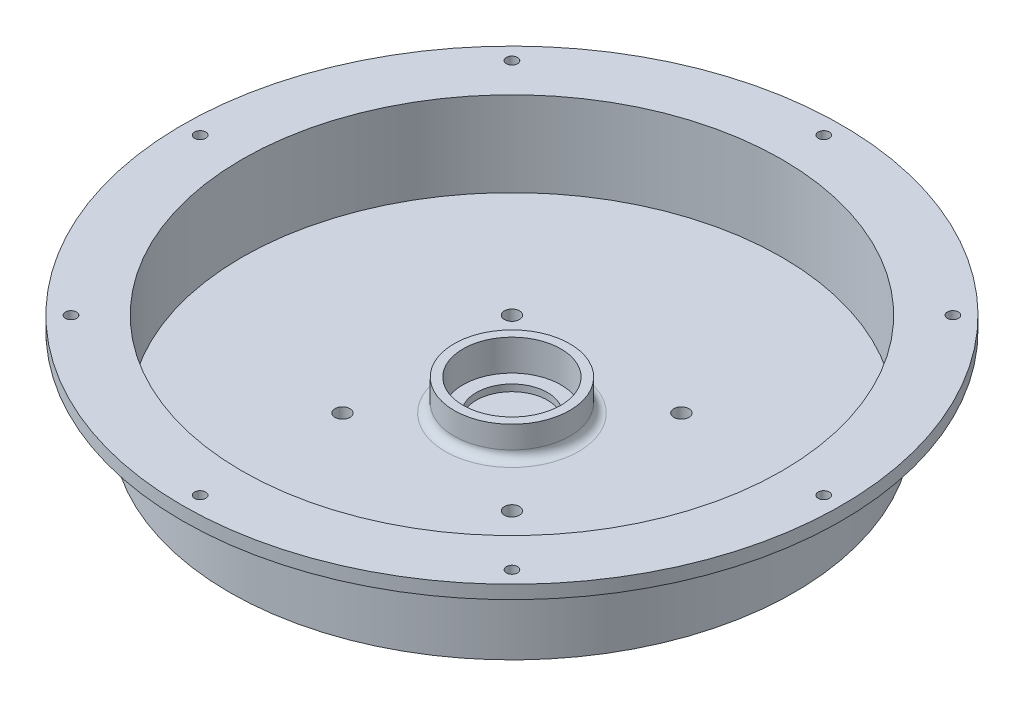
ISO-10303-21;
HEADER;
FILE_DESCRIPTION(('STEP AP214'),'2;1');
FILE_NAME('part.step','',(''),(''),'','','');
FILE_SCHEMA(('AUTOMOTIVE_DESIGN { 1 0 10303 214 1 1 1 1 }'));
ENDSEC;
DATA;
#1=APPLICATION_CONTEXT('core data for automotive mechanical design processes');
#2=APPLICATION_PROTOCOL_DEFINITION('international standard','automotive_design',2000,#1);
#3=PRODUCT_CONTEXT('',#1,'mechanical');
#4=PRODUCT('Part','Part','',(#3));
#5=PRODUCT_RELATED_PRODUCT_CATEGORY('part','',(#4));
#6=PRODUCT_DEFINITION_FORMATION('','',#4);
#7=PRODUCT_DEFINITION_CONTEXT('part definition',#1,'design');
#8=PRODUCT_DEFINITION('design','',#6,#7);
#9=PRODUCT_DEFINITION_SHAPE('','',#8);
#10=(LENGTH_UNIT() NAMED_UNIT(*) SI_UNIT(.MILLI.,.METRE.));
#11=(NAMED_UNIT(*) PLANE_ANGLE_UNIT() SI_UNIT($,.RADIAN.));
#12=(NAMED_UNIT(*) SI_UNIT($,.STERADIAN.) SOLID_ANGLE_UNIT());
#13=UNCERTAINTY_MEASURE_WITH_UNIT(LENGTH_MEASURE(1.E-05),#10,'distance_accuracy_value','');
#14=(GEOMETRIC_REPRESENTATION_CONTEXT(3) GLOBAL_UNCERTAINTY_ASSIGNED_CONTEXT((#13)) GLOBAL_UNIT_ASSIGNED_CONTEXT((#10,
#11,#12)) REPRESENTATION_CONTEXT('',''));
#15=CARTESIAN_POINT('',(0.,0.,0.));
#16=DIRECTION('',(0.,0.,1.));
#17=DIRECTION('',(1.,0.,0.));
#18=AXIS2_PLACEMENT_3D('',#15,#16,#17);
#19=CARTESIAN_POINT('',(0.,22.225,0.));
#20=DIRECTION('',(0.,1.,0.));
#21=DIRECTION('',(0.,0.,1.));
#22=AXIS2_PLACEMENT_3D('',#19,#20,#21);
#23=PLANE('',#22);
#24=CARTESIAN_POINT('',(-49.5681853611776,22.225,-49.5681853611764));
#25=DIRECTION('',(0.,1.,0.));
#26=DIRECTION('',(0.,0.,1.));
#27=AXIS2_PLACEMENT_3D('',#24,#25,#26);
#28=CIRCLE('',#27,1.24999999999999);
#29=CARTESIAN_POINT('',(-49.5681853611776,22.225,-48.3181853611764));
#30=VERTEX_POINT('',#29);
#31=EDGE_CURVE('E98',#30,#30,#28,.T.);
#32=ORIENTED_EDGE('',*,*,#31,.F.);
#33=EDGE_LOOP('',(#32));
#34=FACE_BOUND('',#33,.T.);
#35=CARTESIAN_POINT('',(-7.34258525558711E-13,22.225,-70.1));
#36=DIRECTION('',(0.,1.,0.));
#37=DIRECTION('',(0.,0.,1.));
#38=AXIS2_PLACEMENT_3D('',#35,#36,#37);
#39=CIRCLE('',#38,1.24999999999999);
#40=CARTESIAN_POINT('',(-7.34258525558711E-13,22.225,-68.85));
#41=VERTEX_POINT('',#40);
#42=EDGE_CURVE('E97',#41,#41,#39,.T.);
#43=ORIENTED_EDGE('',*,*,#42,.F.);
#44=EDGE_LOOP('',(#43));
#45=FACE_BOUND('',#44,.T.);
#46=CARTESIAN_POINT('',(49.5681853611765,22.225,-49.5681853611774));
#47=DIRECTION('',(0.,1.,0.));
#48=DIRECTION('',(0.,0.,1.));
#49=AXIS2_PLACEMENT_3D('',#46,#47,#48);
#50=CIRCLE('',#49,1.24999999999999);
#51=CARTESIAN_POINT('',(49.5681853611765,22.225,-48.3181853611774));
#52=VERTEX_POINT('',#51);
#53=EDGE_CURVE('E104',#52,#52,#50,.T.);
#54=ORIENTED_EDGE('',*,*,#53,.F.);
#55=EDGE_LOOP('',(#54));
#56=FACE_BOUND('',#55,.T.);
#57=CARTESIAN_POINT('',(70.1,22.225,0.));
#58=DIRECTION('',(0.,1.,0.));
#59=DIRECTION('',(0.,0.,1.));
#60=AXIS2_PLACEMENT_3D('',#57,#58,#59);
#61=CIRCLE('',#60,1.24999999999999);
#62=CARTESIAN_POINT('',(70.1,22.225,1.24999999999999));
#63=VERTEX_POINT('',#62);
#64=EDGE_CURVE('E103',#63,#63,#61,.T.);
#65=ORIENTED_EDGE('',*,*,#64,.F.);
#66=EDGE_LOOP('',(#65));
#67=FACE_BOUND('',#66,.T.);
#68=CARTESIAN_POINT('',(49.5681853611772,22.225,49.5681853611767));
#69=DIRECTION('',(0.,1.,0.));
#70=DIRECTION('',(0.,0.,1.));
#71=AXIS2_PLACEMENT_3D('',#68,#69,#70);
#72=CIRCLE('',#71,1.24999999999999);
#73=CARTESIAN_POINT('',(49.5681853611772,22.225,50.8181853611767));
#74=VERTEX_POINT('',#73);
#75=EDGE_CURVE('E108',#74,#74,#72,.T.);
#76=ORIENTED_EDGE('',*,*,#75,.F.);
#77=EDGE_LOOP('',(#76));
#78=FACE_BOUND('',#77,.T.);
#79=CARTESIAN_POINT('',(2.44752841852904E-13,22.225,70.1));
#80=DIRECTION('',(0.,1.,0.));
#81=DIRECTION('',(0.,0.,1.));
#82=AXIS2_PLACEMENT_3D('',#79,#80,#81);
#83=CIRCLE('',#82,1.24999999999999);
#84=CARTESIAN_POINT('',(2.44752841852904E-13,22.225,71.35));
#85=VERTEX_POINT('',#84);
#86=EDGE_CURVE('E113',#85,#85,#83,.T.);
#87=ORIENTED_EDGE('',*,*,#86,.F.);
#88=EDGE_LOOP('',(#87));
#89=FACE_BOUND('',#88,.T.);
#90=CARTESIAN_POINT('',(-49.5681853611769,22.225,49.5681853611771));
#91=DIRECTION('',(0.,1.,0.));
#92=DIRECTION('',(0.,0.,1.));
#93=AXIS2_PLACEMENT_3D('',#90,#91,#92);
#94=CIRCLE('',#93,1.24999999999999);
#95=CARTESIAN_POINT('',(-49.5681853611769,22.225,50.8181853611771));
#96=VERTEX_POINT('',#95);
#97=EDGE_CURVE('E119',#96,#96,#94,.T.);
#98=ORIENTED_EDGE('',*,*,#97,.F.);
#99=EDGE_LOOP('',(#98));
#100=FACE_BOUND('',#99,.T.);
#101=CARTESIAN_POINT('',(-70.1,22.225,0.));
#102=DIRECTION('',(0.,1.,0.));
#103=DIRECTION('',(0.,0.,1.));
#104=AXIS2_PLACEMENT_3D('',#101,#102,#103);
#105=CIRCLE('',#104,1.24999999999999);
#106=CARTESIAN_POINT('',(-70.1,22.225,1.24999999999999));
#107=VERTEX_POINT('',#106);
#108=EDGE_CURVE('E118',#107,#107,#105,.T.);
#109=ORIENTED_EDGE('',*,*,#108,.F.);
#110=EDGE_LOOP('',(#109));
#111=FACE_BOUND('',#110,.T.);
#112=CARTESIAN_POINT('',(0.,22.225,0.));
#113=DIRECTION('',(0.,1.,0.));
#114=DIRECTION('',(0.,0.,1.));
#115=AXIS2_PLACEMENT_3D('',#112,#113,#114);
#116=CIRCLE('',#115,60.690000065);
#117=CARTESIAN_POINT('',(0.,22.225,60.690000065));
#118=VERTEX_POINT('',#117);
#119=EDGE_CURVE('E136',#118,#118,#116,.T.);
#120=ORIENTED_EDGE('',*,*,#119,.F.);
#121=EDGE_LOOP('',(#120));
#122=FACE_BOUND('',#121,.T.);
#123=CARTESIAN_POINT('',(0.,22.225,0.));
#124=DIRECTION('',(0.,1.,0.));
#125=DIRECTION('',(0.,0.,1.));
#126=AXIS2_PLACEMENT_3D('',#123,#124,#125);
#127=CIRCLE('',#126,74.0950000325);
#128=CARTESIAN_POINT('',(0.,22.225,74.0950000325));
#129=VERTEX_POINT('',#128);
#130=EDGE_CURVE('E124',#129,#129,#127,.T.);
#131=ORIENTED_EDGE('',*,*,#130,.T.);
#132=EDGE_LOOP('',(#131));
#133=FACE_BOUND('',#132,.T.);
#134=ADVANCED_FACE('F62',(#34,#45,#56,#67,#78,#89,#100,#111,#122,#133),#23,.T.);
#135=CARTESIAN_POINT('',(0.,22.225,0.));
#136=DIRECTION('',(0.,-1.,0.));
#137=DIRECTION('',(0.,0.,-1.));
#138=AXIS2_PLACEMENT_3D('',#135,#136,#137);
#139=CYLINDRICAL_SURFACE('',#138,60.690000065);
#140=CARTESIAN_POINT('',(0.,3.175,0.));
#141=DIRECTION('',(0.,1.,0.));
#142=DIRECTION('',(0.,0.,1.));
#143=AXIS2_PLACEMENT_3D('',#140,#141,#142);
#144=CIRCLE('',#143,60.690000065);
#145=CARTESIAN_POINT('',(0.,3.175,60.690000065));
#146=VERTEX_POINT('',#145);
#147=EDGE_CURVE('E128',#146,#146,#144,.T.);
#148=ORIENTED_EDGE('',*,*,#147,.F.);
#149=EDGE_LOOP('',(#148));
#150=FACE_BOUND('',#149,.T.);
#151=ORIENTED_EDGE('',*,*,#119,.T.);
#152=EDGE_LOOP('',(#151));
#153=FACE_BOUND('',#152,.T.);
#154=ADVANCED_FACE('F232',(#150,#153),#139,.F.);
#155=CARTESIAN_POINT('',(0.,3.175,0.));
#156=DIRECTION('',(0.,1.,0.));
#157=DIRECTION('',(0.,0.,1.));
#158=AXIS2_PLACEMENT_3D('',#155,#156,#157);
#159=PLANE('',#158);
#160=CARTESIAN_POINT('',(19.05,3.175,-19.05));
#161=DIRECTION('',(0.,1.,0.));
#162=DIRECTION('',(0.,0.,1.));
#163=AXIS2_PLACEMENT_3D('',#160,#161,#162);
#164=CIRCLE('',#163,1.7);
#165=CARTESIAN_POINT('',(19.05,3.175,-17.35));
#166=VERTEX_POINT('',#165);
#167=EDGE_CURVE('E198',#166,#166,#164,.T.);
#168=ORIENTED_EDGE('',*,*,#167,.F.);
#169=EDGE_LOOP('',(#168));
#170=FACE_BOUND('',#169,.T.);
#171=CARTESIAN_POINT('',(-19.05,3.175,19.05));
#172=DIRECTION('',(0.,1.,0.));
#173=DIRECTION('',(0.,0.,1.));
#174=AXIS2_PLACEMENT_3D('',#171,#172,#173);
#175=CIRCLE('',#174,1.7);
#176=CARTESIAN_POINT('',(-19.05,3.175,20.75));
#177=VERTEX_POINT('',#176);
#178=EDGE_CURVE('E205',#177,#177,#175,.T.);
#179=ORIENTED_EDGE('',*,*,#178,.F.);
#180=EDGE_LOOP('',(#179));
#181=FACE_BOUND('',#180,.T.);
#182=CARTESIAN_POINT('',(-19.05,3.175,-19.05));
#183=DIRECTION('',(0.,1.,0.));
#184=DIRECTION('',(0.,0.,1.));
#185=AXIS2_PLACEMENT_3D('',#182,#183,#184);
#186=CIRCLE('',#185,1.7);
#187=CARTESIAN_POINT('',(-19.05,3.175,-17.35));
#188=VERTEX_POINT('',#187);
#189=EDGE_CURVE('E206',#188,#188,#186,.T.);
#190=ORIENTED_EDGE('',*,*,#189,.F.);
#191=EDGE_LOOP('',(#190));
#192=FACE_BOUND('',#191,.T.);
#193=CARTESIAN_POINT('',(19.05,3.175,19.05));
#194=DIRECTION('',(0.,1.,0.));
#195=DIRECTION('',(0.,0.,1.));
#196=AXIS2_PLACEMENT_3D('',#193,#194,#195);
#197=CIRCLE('',#196,1.7);
#198=CARTESIAN_POINT('',(19.05,3.175,20.75));
#199=VERTEX_POINT('',#198);
#200=EDGE_CURVE('E194',#199,#199,#197,.T.);
#201=ORIENTED_EDGE('',*,*,#200,.F.);
#202=EDGE_LOOP('',(#201));
#203=FACE_BOUND('',#202,.T.);
#204=CARTESIAN_POINT('',(0.,3.175,0.));
#205=DIRECTION('',(0.,1.,0.));
#206=DIRECTION('',(0.,0.,1.));
#207=AXIS2_PLACEMENT_3D('',#204,#205,#206);
#208=CIRCLE('',#207,15.);
#209=CARTESIAN_POINT('',(0.,3.175,15.));
#210=VERTEX_POINT('',#209);
#211=EDGE_CURVE('E78',#210,#210,#208,.F.);
#212=ORIENTED_EDGE('',*,*,#211,.T.);
#213=EDGE_LOOP('',(#212));
#214=FACE_BOUND('',#213,.T.);
#215=ORIENTED_EDGE('',*,*,#147,.T.);
#216=EDGE_LOOP('',(#215));
#217=FACE_BOUND('',#216,.T.);
#218=ADVANCED_FACE('F228',(#170,#181,#192,#203,#214,#217),#159,.T.);
#219=CARTESIAN_POINT('',(0.,10.175,0.));
#220=DIRECTION('',(0.,1.,0.));
#221=DIRECTION('',(0.,0.,1.));
#222=AXIS2_PLACEMENT_3D('',#219,#220,#221);
#223=PLANE('',#222);
#224=CARTESIAN_POINT('',(0.,10.175,0.));
#225=DIRECTION('',(0.,1.,0.));
#226=DIRECTION('',(0.,0.,1.));
#227=AXIS2_PLACEMENT_3D('',#224,#225,#226);
#228=CIRCLE('',#227,13.);
#229=CARTESIAN_POINT('',(0.,10.175,13.));
#230=VERTEX_POINT('',#229);
#231=EDGE_CURVE('E140',#230,#230,#228,.T.);
#232=ORIENTED_EDGE('',*,*,#231,.T.);
#233=EDGE_LOOP('',(#232));
#234=FACE_BOUND('',#233,.T.);
#235=CARTESIAN_POINT('',(0.,10.175,0.));
#236=DIRECTION('',(0.,1.,0.));
#237=DIRECTION('',(0.,0.,1.));
#238=AXIS2_PLACEMENT_3D('',#235,#236,#237);
#239=CIRCLE('',#238,11.);
#240=CARTESIAN_POINT('',(0.,10.175,11.));
#241=VERTEX_POINT('',#240);
#242=EDGE_CURVE('E144',#241,#241,#239,.T.);
#243=ORIENTED_EDGE('',*,*,#242,.F.);
#244=EDGE_LOOP('',(#243));
#245=FACE_BOUND('',#244,.T.);
#246=ADVANCED_FACE('F231',(#234,#245),#223,.T.);
#247=CARTESIAN_POINT('',(0.,10.175,0.));
#248=DIRECTION('',(0.,-1.,0.));
#249=DIRECTION('',(0.,0.,-1.));
#250=AXIS2_PLACEMENT_3D('',#247,#248,#249);
#251=CYLINDRICAL_SURFACE('',#250,13.);
#252=CARTESIAN_POINT('',(0.,5.175,0.));
#253=DIRECTION('',(0.,1.,0.));
#254=DIRECTION('',(0.,0.,1.));
#255=AXIS2_PLACEMENT_3D('',#252,#253,#254);
#256=CIRCLE('',#255,13.);
#257=CARTESIAN_POINT('',(0.,5.175,13.));
#258=VERTEX_POINT('',#257);
#259=EDGE_CURVE('E86',#258,#258,#256,.T.);
#260=ORIENTED_EDGE('',*,*,#259,.T.);
#261=EDGE_LOOP('',(#260));
#262=FACE_BOUND('',#261,.T.);
#263=ORIENTED_EDGE('',*,*,#231,.F.);
#264=EDGE_LOOP('',(#263));
#265=FACE_BOUND('',#264,.T.);
#266=ADVANCED_FACE('F269',(#262,#265),#251,.T.);
#267=CARTESIAN_POINT('',(0.,10.175,0.));
#268=DIRECTION('',(0.,-1.,0.));
#269=DIRECTION('',(0.,0.,-1.));
#270=AXIS2_PLACEMENT_3D('',#267,#268,#269);
#271=CYLINDRICAL_SURFACE('',#270,11.);
#272=ORIENTED_EDGE('',*,*,#242,.T.);
#273=EDGE_LOOP('',(#272));
#274=FACE_BOUND('',#273,.T.);
#275=CARTESIAN_POINT('',(0.,3.175,0.));
#276=DIRECTION('',(0.,1.,0.));
#277=DIRECTION('',(0.,0.,1.));
#278=AXIS2_PLACEMENT_3D('',#275,#276,#277);
#279=CIRCLE('',#278,11.);
#280=CARTESIAN_POINT('',(0.,3.175,11.));
#281=VERTEX_POINT('',#280);
#282=EDGE_CURVE('E92',#281,#281,#279,.F.);
#283=ORIENTED_EDGE('',*,*,#282,.T.);
#284=EDGE_LOOP('',(#283));
#285=FACE_BOUND('',#284,.T.);
#286=ADVANCED_FACE('F263',(#274,#285),#271,.F.);
#287=CARTESIAN_POINT('',(0.,3.175,0.));
#288=DIRECTION('',(0.,1.,0.));
#289=DIRECTION('',(0.,0.,1.));
#290=AXIS2_PLACEMENT_3D('',#287,#288,#289);
#291=CIRCLE('',#290,8.);
#292=CARTESIAN_POINT('',(0.,3.175,8.));
#293=VERTEX_POINT('',#292);
#294=EDGE_CURVE('E186',#293,#293,#291,.T.);
#295=ORIENTED_EDGE('',*,*,#294,.F.);
#296=EDGE_LOOP('',(#295));
#297=FACE_BOUND('',#296,.T.);
#298=ORIENTED_EDGE('',*,*,#282,.F.);
#299=EDGE_LOOP('',(#298));
#300=FACE_BOUND('',#299,.T.);
#301=ADVANCED_FACE('F235',(#297,#300),#159,.T.);
#302=CARTESIAN_POINT('',(0.,19.225,0.));
#303=DIRECTION('',(0.,1.,0.));
#304=DIRECTION('',(0.,0.,1.));
#305=AXIS2_PLACEMENT_3D('',#302,#303,#304);
#306=CYLINDRICAL_SURFACE('',#305,74.0950000325);
#307=CARTESIAN_POINT('',(0.,19.225,0.));
#308=DIRECTION('',(0.,1.,0.));
#309=DIRECTION('',(0.,0.,1.));
#310=AXIS2_PLACEMENT_3D('',#307,#308,#309);
#311=CIRCLE('',#310,74.0950000325);
#312=CARTESIAN_POINT('',(0.,19.225,74.0950000325));
#313=VERTEX_POINT('',#312);
#314=EDGE_CURVE('E147',#313,#313,#311,.T.);
#315=ORIENTED_EDGE('',*,*,#314,.T.);
#316=EDGE_LOOP('',(#315));
#317=FACE_BOUND('',#316,.T.);
#318=ORIENTED_EDGE('',*,*,#130,.F.);
#319=EDGE_LOOP('',(#318));
#320=FACE_BOUND('',#319,.T.);
#321=ADVANCED_FACE('F253',(#317,#320),#306,.T.);
#322=CARTESIAN_POINT('',(0.,19.225,0.));
#323=DIRECTION('',(0.,1.,0.));
#324=DIRECTION('',(0.,0.,1.));
#325=AXIS2_PLACEMENT_3D('',#322,#323,#324);
#326=PLANE('',#325);
#327=CARTESIAN_POINT('',(0.,19.225,0.));
#328=DIRECTION('',(0.,1.,0.));
#329=DIRECTION('',(0.,0.,1.));
#330=AXIS2_PLACEMENT_3D('',#327,#328,#329);
#331=CIRCLE('',#330,66.5);
#332=CARTESIAN_POINT('',(0.,19.225,66.5));
#333=VERTEX_POINT('',#332);
#334=EDGE_CURVE('E70',#333,#333,#331,.T.);
#335=ORIENTED_EDGE('',*,*,#334,.T.);
#336=EDGE_LOOP('',(#335));
#337=FACE_BOUND('',#336,.T.);
#338=CARTESIAN_POINT('',(-49.5681853611776,19.225,-49.5681853611764));
#339=DIRECTION('',(0.,1.,0.));
#340=DIRECTION('',(0.,0.,1.));
#341=AXIS2_PLACEMENT_3D('',#338,#339,#340);
#342=CIRCLE('',#341,1.24999999999999);
#343=CARTESIAN_POINT('',(-49.5681853611776,19.225,-48.3181853611764));
#344=VERTEX_POINT('',#343);
#345=EDGE_CURVE('E93',#344,#344,#342,.T.);
#346=ORIENTED_EDGE('',*,*,#345,.T.);
#347=EDGE_LOOP('',(#346));
#348=FACE_BOUND('',#347,.T.);
#349=CARTESIAN_POINT('',(-7.34258525558711E-13,19.225,-70.1));
#350=DIRECTION('',(0.,1.,0.));
#351=DIRECTION('',(0.,0.,1.));
#352=AXIS2_PLACEMENT_3D('',#349,#350,#351);
#353=CIRCLE('',#352,1.24999999999999);
#354=CARTESIAN_POINT('',(-7.34258525558711E-13,19.225,-68.85));
#355=VERTEX_POINT('',#354);
#356=EDGE_CURVE('E175',#355,#355,#353,.T.);
#357=ORIENTED_EDGE('',*,*,#356,.T.);
#358=EDGE_LOOP('',(#357));
#359=FACE_BOUND('',#358,.T.);
#360=CARTESIAN_POINT('',(49.5681853611765,19.225,-49.5681853611774));
#361=DIRECTION('',(0.,1.,0.));
#362=DIRECTION('',(0.,0.,1.));
#363=AXIS2_PLACEMENT_3D('',#360,#361,#362);
#364=CIRCLE('',#363,1.24999999999999);
#365=CARTESIAN_POINT('',(49.5681853611765,19.225,-48.3181853611774));
#366=VERTEX_POINT('',#365);
#367=EDGE_CURVE('E99',#366,#366,#364,.T.);
#368=ORIENTED_EDGE('',*,*,#367,.T.);
#369=EDGE_LOOP('',(#368));
#370=FACE_BOUND('',#369,.T.);
#371=CARTESIAN_POINT('',(70.1,19.225,0.));
#372=DIRECTION('',(0.,1.,0.));
#373=DIRECTION('',(0.,0.,1.));
#374=AXIS2_PLACEMENT_3D('',#371,#372,#373);
#375=CIRCLE('',#374,1.24999999999999);
#376=CARTESIAN_POINT('',(70.1,19.225,1.24999999999999));
#377=VERTEX_POINT('',#376);
#378=EDGE_CURVE('E105',#377,#377,#375,.T.);
#379=ORIENTED_EDGE('',*,*,#378,.T.);
#380=EDGE_LOOP('',(#379));
#381=FACE_BOUND('',#380,.T.);
#382=CARTESIAN_POINT('',(49.5681853611772,19.225,49.5681853611767));
#383=DIRECTION('',(0.,1.,0.));
#384=DIRECTION('',(0.,0.,1.));
#385=AXIS2_PLACEMENT_3D('',#382,#383,#384);
#386=CIRCLE('',#385,1.24999999999999);
#387=CARTESIAN_POINT('',(49.5681853611772,19.225,50.8181853611767));
#388=VERTEX_POINT('',#387);
#389=EDGE_CURVE('E109',#388,#388,#386,.T.);
#390=ORIENTED_EDGE('',*,*,#389,.T.);
#391=EDGE_LOOP('',(#390));
#392=FACE_BOUND('',#391,.T.);
#393=CARTESIAN_POINT('',(2.44752841852904E-13,19.225,70.1));
#394=DIRECTION('',(0.,1.,0.));
#395=DIRECTION('',(0.,0.,1.));
#396=AXIS2_PLACEMENT_3D('',#393,#394,#395);
#397=CIRCLE('',#396,1.24999999999999);
#398=CARTESIAN_POINT('',(2.44752841852904E-13,19.225,71.35));
#399=VERTEX_POINT('',#398);
#400=EDGE_CURVE('E159',#399,#399,#397,.T.);
#401=ORIENTED_EDGE('',*,*,#400,.T.);
#402=EDGE_LOOP('',(#401));
#403=FACE_BOUND('',#402,.T.);
#404=CARTESIAN_POINT('',(-49.5681853611769,19.225,49.5681853611771));
#405=DIRECTION('',(0.,1.,0.));
#406=DIRECTION('',(0.,0.,1.));
#407=AXIS2_PLACEMENT_3D('',#404,#405,#406);
#408=CIRCLE('',#407,1.24999999999999);
#409=CARTESIAN_POINT('',(-49.5681853611769,19.225,50.8181853611771));
#410=VERTEX_POINT('',#409);
#411=EDGE_CURVE('E114',#410,#410,#408,.T.);
#412=ORIENTED_EDGE('',*,*,#411,.T.);
#413=EDGE_LOOP('',(#412));
#414=FACE_BOUND('',#413,.T.);
#415=CARTESIAN_POINT('',(-70.1,19.225,0.));
#416=DIRECTION('',(0.,1.,0.));
#417=DIRECTION('',(0.,0.,1.));
#418=AXIS2_PLACEMENT_3D('',#415,#416,#417);
#419=CIRCLE('',#418,1.24999999999999);
#420=CARTESIAN_POINT('',(-70.1,19.225,1.24999999999999));
#421=VERTEX_POINT('',#420);
#422=EDGE_CURVE('E120',#421,#421,#419,.T.);
#423=ORIENTED_EDGE('',*,*,#422,.T.);
#424=EDGE_LOOP('',(#423));
#425=FACE_BOUND('',#424,.T.);
#426=ORIENTED_EDGE('',*,*,#314,.F.);
#427=EDGE_LOOP('',(#426));
#428=FACE_BOUND('',#427,.T.);
#429=ADVANCED_FACE('F255',(#337,#348,#359,#370,#381,#392,#403,#414,#425,#428),#326,.F.);
#430=CARTESIAN_POINT('',(0.,0.,0.));
#431=DIRECTION('',(0.,1.,0.));
#432=DIRECTION('',(0.,0.,1.));
#433=AXIS2_PLACEMENT_3D('',#430,#431,#432);
#434=PLANE('',#433);
#435=CARTESIAN_POINT('',(19.05,0.,-19.05));
#436=DIRECTION('',(0.,1.,0.));
#437=DIRECTION('',(0.,0.,1.));
#438=AXIS2_PLACEMENT_3D('',#435,#436,#437);
#439=CIRCLE('',#438,1.7);
#440=CARTESIAN_POINT('',(19.05,0.,-17.35));
#441=VERTEX_POINT('',#440);
#442=EDGE_CURVE('E210',#441,#441,#439,.T.);
#443=ORIENTED_EDGE('',*,*,#442,.T.);
#444=EDGE_LOOP('',(#443));
#445=FACE_BOUND('',#444,.T.);
#446=CARTESIAN_POINT('',(-19.05,0.,19.05));
#447=DIRECTION('',(0.,1.,0.));
#448=DIRECTION('',(0.,0.,1.));
#449=AXIS2_PLACEMENT_3D('',#446,#447,#448);
#450=CIRCLE('',#449,1.7);
#451=CARTESIAN_POINT('',(-19.05,0.,20.75));
#452=VERTEX_POINT('',#451);
#453=EDGE_CURVE('E202',#452,#452,#450,.T.);
#454=ORIENTED_EDGE('',*,*,#453,.T.);
#455=EDGE_LOOP('',(#454));
#456=FACE_BOUND('',#455,.T.);
#457=CARTESIAN_POINT('',(-19.05,0.,-19.05));
#458=DIRECTION('',(0.,1.,0.));
#459=DIRECTION('',(0.,0.,1.));
#460=AXIS2_PLACEMENT_3D('',#457,#458,#459);
#461=CIRCLE('',#460,1.7);
#462=CARTESIAN_POINT('',(-19.05,0.,-17.35));
#463=VERTEX_POINT('',#462);
#464=EDGE_CURVE('E217',#463,#463,#461,.T.);
#465=ORIENTED_EDGE('',*,*,#464,.T.);
#466=EDGE_LOOP('',(#465));
#467=FACE_BOUND('',#466,.T.);
#468=CARTESIAN_POINT('',(19.05,0.,19.05));
#469=DIRECTION('',(0.,1.,0.));
#470=DIRECTION('',(0.,0.,1.));
#471=AXIS2_PLACEMENT_3D('',#468,#469,#470);
#472=CIRCLE('',#471,1.7);
#473=CARTESIAN_POINT('',(19.05,0.,20.75));
#474=VERTEX_POINT('',#473);
#475=EDGE_CURVE('E190',#474,#474,#472,.T.);
#476=ORIENTED_EDGE('',*,*,#475,.T.);
#477=EDGE_LOOP('',(#476));
#478=FACE_BOUND('',#477,.T.);
#479=CARTESIAN_POINT('',(0.,0.,0.));
#480=DIRECTION('',(0.,1.,0.));
#481=DIRECTION('',(0.,0.,1.));
#482=AXIS2_PLACEMENT_3D('',#479,#480,#481);
#483=CIRCLE('',#482,63.5);
#484=CARTESIAN_POINT('',(0.,0.,63.5));
#485=VERTEX_POINT('',#484);
#486=EDGE_CURVE('E132',#485,#485,#483,.T.);
#487=ORIENTED_EDGE('',*,*,#486,.F.);
#488=EDGE_LOOP('',(#487));
#489=FACE_BOUND('',#488,.T.);
#490=ADVANCED_FACE('F261',(#445,#456,#467,#478,#489),#434,.F.);
#491=CARTESIAN_POINT('',(0.,22.225,0.));
#492=DIRECTION('',(0.,-1.,0.));
#493=DIRECTION('',(0.,0.,-1.));
#494=AXIS2_PLACEMENT_3D('',#491,#492,#493);
#495=CYLINDRICAL_SURFACE('',#494,63.5);
#496=CARTESIAN_POINT('',(0.,16.225,0.));
#497=DIRECTION('',(0.,1.,0.));
#498=DIRECTION('',(0.,0.,1.));
#499=AXIS2_PLACEMENT_3D('',#496,#497,#498);
#500=CIRCLE('',#499,63.5);
#501=CARTESIAN_POINT('',(0.,16.225,63.5));
#502=VERTEX_POINT('',#501);
#503=EDGE_CURVE('E11',#502,#502,#500,.F.);
#504=ORIENTED_EDGE('',*,*,#503,.T.);
#505=EDGE_LOOP('',(#504));
#506=FACE_BOUND('',#505,.T.);
#507=ORIENTED_EDGE('',*,*,#486,.T.);
#508=EDGE_LOOP('',(#507));
#509=FACE_BOUND('',#508,.T.);
#510=ADVANCED_FACE('F279',(#506,#509),#495,.T.);
#511=CARTESIAN_POINT('',(-70.1,22.225,0.));
#512=DIRECTION('',(0.,1.,0.));
#513=DIRECTION('',(0.,0.,1.));
#514=AXIS2_PLACEMENT_3D('',#511,#512,#513);
#515=CYLINDRICAL_SURFACE('',#514,1.24999999999999);
#516=ORIENTED_EDGE('',*,*,#108,.T.);
#517=EDGE_LOOP('',(#516));
#518=FACE_BOUND('',#517,.T.);
#519=ORIENTED_EDGE('',*,*,#422,.F.);
#520=EDGE_LOOP('',(#519));
#521=FACE_BOUND('',#520,.T.);
#522=ADVANCED_FACE('F282',(#518,#521),#515,.F.);
#523=CARTESIAN_POINT('',(-49.5681853611769,22.225,49.5681853611771));
#524=DIRECTION('',(0.,1.,0.));
#525=DIRECTION('',(0.,0.,1.));
#526=AXIS2_PLACEMENT_3D('',#523,#524,#525);
#527=CYLINDRICAL_SURFACE('',#526,1.24999999999999);
#528=ORIENTED_EDGE('',*,*,#97,.T.);
#529=EDGE_LOOP('',(#528));
#530=FACE_BOUND('',#529,.T.);
#531=ORIENTED_EDGE('',*,*,#411,.F.);
#532=EDGE_LOOP('',(#531));
#533=FACE_BOUND('',#532,.T.);
#534=ADVANCED_FACE('F334',(#530,#533),#527,.F.);
#535=CARTESIAN_POINT('',(2.44752841852904E-13,22.225,70.1));
#536=DIRECTION('',(0.,1.,0.));
#537=DIRECTION('',(0.,0.,1.));
#538=AXIS2_PLACEMENT_3D('',#535,#536,#537);
#539=CYLINDRICAL_SURFACE('',#538,1.24999999999999);
#540=ORIENTED_EDGE('',*,*,#86,.T.);
#541=EDGE_LOOP('',(#540));
#542=FACE_BOUND('',#541,.T.);
#543=ORIENTED_EDGE('',*,*,#400,.F.);
#544=EDGE_LOOP('',(#543));
#545=FACE_BOUND('',#544,.T.);
#546=ADVANCED_FACE('F330',(#542,#545),#539,.F.);
#547=CARTESIAN_POINT('',(49.5681853611772,22.225,49.5681853611767));
#548=DIRECTION('',(0.,1.,0.));
#549=DIRECTION('',(0.,0.,1.));
#550=AXIS2_PLACEMENT_3D('',#547,#548,#549);
#551=CYLINDRICAL_SURFACE('',#550,1.24999999999999);
#552=ORIENTED_EDGE('',*,*,#75,.T.);
#553=EDGE_LOOP('',(#552));
#554=FACE_BOUND('',#553,.T.);
#555=ORIENTED_EDGE('',*,*,#389,.F.);
#556=EDGE_LOOP('',(#555));
#557=FACE_BOUND('',#556,.T.);
#558=ADVANCED_FACE('F326',(#554,#557),#551,.F.);
#559=CARTESIAN_POINT('',(70.1,22.225,0.));
#560=DIRECTION('',(0.,1.,0.));
#561=DIRECTION('',(0.,0.,1.));
#562=AXIS2_PLACEMENT_3D('',#559,#560,#561);
#563=CYLINDRICAL_SURFACE('',#562,1.24999999999999);
#564=ORIENTED_EDGE('',*,*,#64,.T.);
#565=EDGE_LOOP('',(#564));
#566=FACE_BOUND('',#565,.T.);
#567=ORIENTED_EDGE('',*,*,#378,.F.);
#568=EDGE_LOOP('',(#567));
#569=FACE_BOUND('',#568,.T.);
#570=ADVANCED_FACE('F322',(#566,#569),#563,.F.);
#571=CARTESIAN_POINT('',(49.5681853611765,22.225,-49.5681853611774));
#572=DIRECTION('',(0.,1.,0.));
#573=DIRECTION('',(0.,0.,1.));
#574=AXIS2_PLACEMENT_3D('',#571,#572,#573);
#575=CYLINDRICAL_SURFACE('',#574,1.24999999999999);
#576=ORIENTED_EDGE('',*,*,#53,.T.);
#577=EDGE_LOOP('',(#576));
#578=FACE_BOUND('',#577,.T.);
#579=ORIENTED_EDGE('',*,*,#367,.F.);
#580=EDGE_LOOP('',(#579));
#581=FACE_BOUND('',#580,.T.);
#582=ADVANCED_FACE('F318',(#578,#581),#575,.F.);
#583=CARTESIAN_POINT('',(-7.34258525558711E-13,22.225,-70.1));
#584=DIRECTION('',(0.,1.,0.));
#585=DIRECTION('',(0.,0.,1.));
#586=AXIS2_PLACEMENT_3D('',#583,#584,#585);
#587=CYLINDRICAL_SURFACE('',#586,1.24999999999999);
#588=ORIENTED_EDGE('',*,*,#42,.T.);
#589=EDGE_LOOP('',(#588));
#590=FACE_BOUND('',#589,.T.);
#591=ORIENTED_EDGE('',*,*,#356,.F.);
#592=EDGE_LOOP('',(#591));
#593=FACE_BOUND('',#592,.T.);
#594=ADVANCED_FACE('F314',(#590,#593),#587,.F.);
#595=CARTESIAN_POINT('',(-49.5681853611776,22.225,-49.5681853611764));
#596=DIRECTION('',(0.,1.,0.));
#597=DIRECTION('',(0.,0.,1.));
#598=AXIS2_PLACEMENT_3D('',#595,#596,#597);
#599=CYLINDRICAL_SURFACE('',#598,1.24999999999999);
#600=ORIENTED_EDGE('',*,*,#31,.T.);
#601=EDGE_LOOP('',(#600));
#602=FACE_BOUND('',#601,.T.);
#603=ORIENTED_EDGE('',*,*,#345,.F.);
#604=EDGE_LOOP('',(#603));
#605=FACE_BOUND('',#604,.T.);
#606=ADVANCED_FACE('F306',(#602,#605),#599,.F.);
#607=CARTESIAN_POINT('',(0.,1.675,0.));
#608=DIRECTION('',(0.,1.,0.));
#609=DIRECTION('',(0.,0.,1.));
#610=AXIS2_PLACEMENT_3D('',#607,#608,#609);
#611=CYLINDRICAL_SURFACE('',#610,8.);
#612=CARTESIAN_POINT('',(0.,1.675,0.));
#613=DIRECTION('',(0.,1.,0.));
#614=DIRECTION('',(0.,0.,1.));
#615=AXIS2_PLACEMENT_3D('',#612,#613,#614);
#616=CIRCLE('',#615,8.);
#617=CARTESIAN_POINT('',(0.,1.675,8.));
#618=VERTEX_POINT('',#617);
#619=EDGE_CURVE('E185',#618,#618,#616,.T.);
#620=ORIENTED_EDGE('',*,*,#619,.F.);
#621=EDGE_LOOP('',(#620));
#622=FACE_BOUND('',#621,.T.);
#623=ORIENTED_EDGE('',*,*,#294,.T.);
#624=EDGE_LOOP('',(#623));
#625=FACE_BOUND('',#624,.T.);
#626=ADVANCED_FACE('F292',(#622,#625),#611,.F.);
#627=CARTESIAN_POINT('',(0.,1.675,0.));
#628=DIRECTION('',(0.,1.,0.));
#629=DIRECTION('',(0.,0.,1.));
#630=AXIS2_PLACEMENT_3D('',#627,#628,#629);
#631=PLANE('',#630);
#632=ORIENTED_EDGE('',*,*,#619,.T.);
#633=EDGE_LOOP('',(#632));
#634=FACE_BOUND('',#633,.T.);
#635=ADVANCED_FACE('F285',(#634),#631,.T.);
#636=CARTESIAN_POINT('',(0.,5.175,0.));
#637=DIRECTION('',(0.,1.,0.));
#638=DIRECTION('',(0.,0.,1.));
#639=AXIS2_PLACEMENT_3D('',#636,#637,#638);
#640=TOROIDAL_SURFACE('',#639,15.,2.);
#641=ORIENTED_EDGE('',*,*,#211,.F.);
#642=EDGE_LOOP('',(#641));
#643=FACE_BOUND('',#642,.T.);
#644=ORIENTED_EDGE('',*,*,#259,.F.);
#645=EDGE_LOOP('',(#644));
#646=FACE_BOUND('',#645,.T.);
#647=ADVANCED_FACE('F283',(#643,#646),#640,.F.);
#648=CARTESIAN_POINT('',(0.,16.225,0.));
#649=DIRECTION('',(0.,1.,0.));
#650=DIRECTION('',(0.,0.,1.));
#651=AXIS2_PLACEMENT_3D('',#648,#649,#650);
#652=TOROIDAL_SURFACE('',#651,66.5,3.);
#653=ORIENTED_EDGE('',*,*,#503,.F.);
#654=EDGE_LOOP('',(#653));
#655=FACE_BOUND('',#654,.T.);
#656=ORIENTED_EDGE('',*,*,#334,.F.);
#657=EDGE_LOOP('',(#656));
#658=FACE_BOUND('',#657,.T.);
#659=ADVANCED_FACE('F64',(#655,#658),#652,.F.);
#660=CARTESIAN_POINT('',(19.05,0.,19.05));
#661=DIRECTION('',(0.,1.,0.));
#662=DIRECTION('',(0.,0.,1.));
#663=AXIS2_PLACEMENT_3D('',#660,#661,#662);
#664=CYLINDRICAL_SURFACE('',#663,1.7);
#665=ORIENTED_EDGE('',*,*,#475,.F.);
#666=EDGE_LOOP('',(#665));
#667=FACE_BOUND('',#666,.T.);
#668=ORIENTED_EDGE('',*,*,#200,.T.);
#669=EDGE_LOOP('',(#668));
#670=FACE_BOUND('',#669,.T.);
#671=ADVANCED_FACE('F290',(#667,#670),#664,.F.);
#672=CARTESIAN_POINT('',(-19.05,0.,-19.05));
#673=DIRECTION('',(0.,1.,0.));
#674=DIRECTION('',(0.,0.,1.));
#675=AXIS2_PLACEMENT_3D('',#672,#673,#674);
#676=CYLINDRICAL_SURFACE('',#675,1.7);
#677=ORIENTED_EDGE('',*,*,#464,.F.);
#678=EDGE_LOOP('',(#677));
#679=FACE_BOUND('',#678,.T.);
#680=ORIENTED_EDGE('',*,*,#189,.T.);
#681=EDGE_LOOP('',(#680));
#682=FACE_BOUND('',#681,.T.);
#683=ADVANCED_FACE('F226',(#679,#682),#676,.F.);
#684=CARTESIAN_POINT('',(-19.05,0.,19.05));
#685=DIRECTION('',(0.,1.,0.));
#686=DIRECTION('',(0.,0.,1.));
#687=AXIS2_PLACEMENT_3D('',#684,#685,#686);
#688=CYLINDRICAL_SURFACE('',#687,1.7);
#689=ORIENTED_EDGE('',*,*,#453,.F.);
#690=EDGE_LOOP('',(#689));
#691=FACE_BOUND('',#690,.T.);
#692=ORIENTED_EDGE('',*,*,#178,.T.);
#693=EDGE_LOOP('',(#692));
#694=FACE_BOUND('',#693,.T.);
#695=ADVANCED_FACE('F460',(#691,#694),#688,.F.);
#696=CARTESIAN_POINT('',(19.05,0.,-19.05));
#697=DIRECTION('',(0.,1.,0.));
#698=DIRECTION('',(0.,0.,1.));
#699=AXIS2_PLACEMENT_3D('',#696,#697,#698);
#700=CYLINDRICAL_SURFACE('',#699,1.7);
#701=ORIENTED_EDGE('',*,*,#442,.F.);
#702=EDGE_LOOP('',(#701));
#703=FACE_BOUND('',#702,.T.);
#704=ORIENTED_EDGE('',*,*,#167,.T.);
#705=EDGE_LOOP('',(#704));
#706=FACE_BOUND('',#705,.T.);
#707=ADVANCED_FACE('F470',(#703,#706),#700,.F.);
#708=CLOSED_SHELL('',(#134,#154,#218,#246,#266,#286,#301,#321,#429,#490,#510,#522,#534,#546,
#558,#570,#582,#594,#606,#626,#635,#647,#659,#671,#683,#695,#707));
#709=MANIFOLD_SOLID_BREP('B2',#708);
#710=ADVANCED_BREP_SHAPE_REPRESENTATION('',(#18,#709),#14);
#711=SHAPE_DEFINITION_REPRESENTATION(#9,#710);
ENDSEC;
END-ISO-10303-21;
